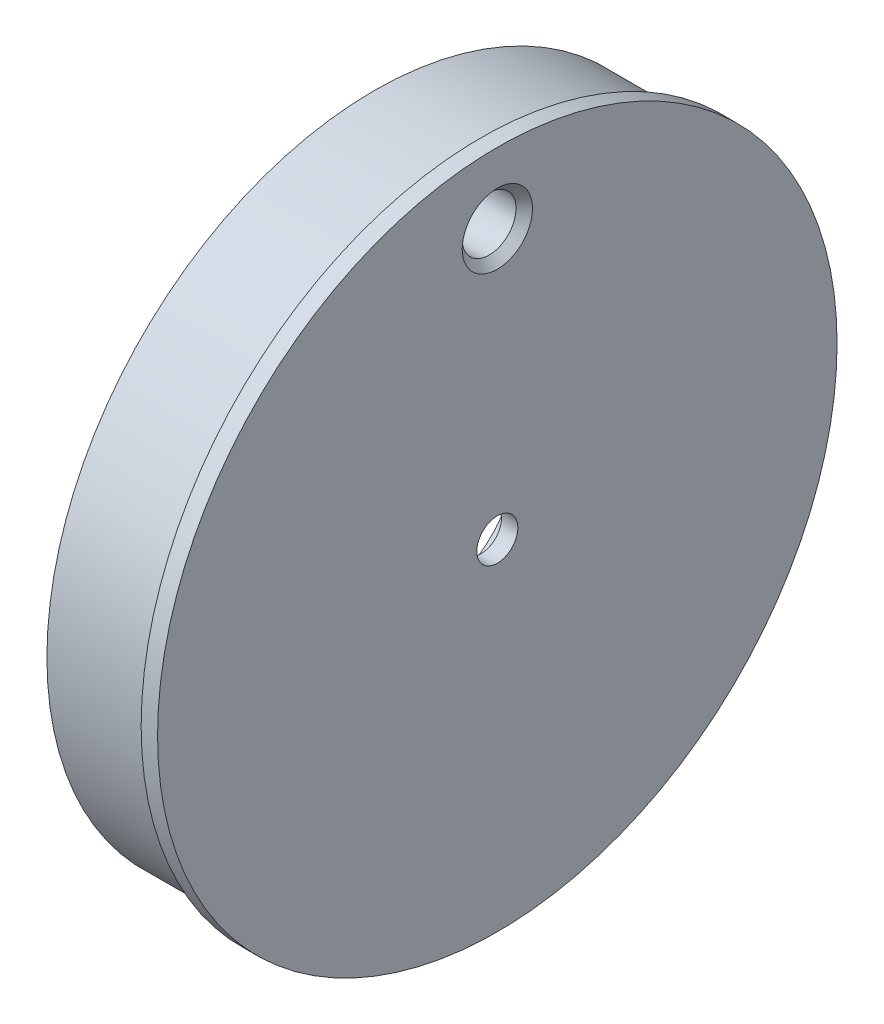
ISO-10303-21;
HEADER;
FILE_DESCRIPTION(('STEP AP214'),'2;1');
FILE_NAME('part.step','',(''),(''),'','','');
FILE_SCHEMA(('AUTOMOTIVE_DESIGN { 1 0 10303 214 1 1 1 1 }'));
ENDSEC;
DATA;
#1=APPLICATION_CONTEXT('core data for automotive mechanical design processes');
#2=APPLICATION_PROTOCOL_DEFINITION('international standard','automotive_design',2000,#1);
#3=PRODUCT_CONTEXT('',#1,'mechanical');
#4=PRODUCT('Part','Part','',(#3));
#5=PRODUCT_RELATED_PRODUCT_CATEGORY('part','',(#4));
#6=PRODUCT_DEFINITION_FORMATION('','',#4);
#7=PRODUCT_DEFINITION_CONTEXT('part definition',#1,'design');
#8=PRODUCT_DEFINITION('design','',#6,#7);
#9=PRODUCT_DEFINITION_SHAPE('','',#8);
#10=(LENGTH_UNIT() NAMED_UNIT(*) SI_UNIT(.MILLI.,.METRE.));
#11=(NAMED_UNIT(*) PLANE_ANGLE_UNIT() SI_UNIT($,.RADIAN.));
#12=(NAMED_UNIT(*) SI_UNIT($,.STERADIAN.) SOLID_ANGLE_UNIT());
#13=UNCERTAINTY_MEASURE_WITH_UNIT(LENGTH_MEASURE(1.E-05),#10,'distance_accuracy_value','');
#14=(GEOMETRIC_REPRESENTATION_CONTEXT(3) GLOBAL_UNCERTAINTY_ASSIGNED_CONTEXT((#13)) GLOBAL_UNIT_ASSIGNED_CONTEXT((#10,
#11,#12)) REPRESENTATION_CONTEXT('',''));
#15=CARTESIAN_POINT('',(0.,0.,0.));
#16=DIRECTION('',(0.,0.,1.));
#17=DIRECTION('',(1.,0.,0.));
#18=AXIS2_PLACEMENT_3D('',#15,#16,#17);
#19=CARTESIAN_POINT('',(0.,0.,0.));
#20=DIRECTION('',(1.,0.,0.));
#21=DIRECTION('',(0.,0.,-1.));
#22=AXIS2_PLACEMENT_3D('',#19,#20,#21);
#23=CYLINDRICAL_SURFACE('',#22,1.5875);
#24=CARTESIAN_POINT('',(0.,0.,0.));
#25=DIRECTION('',(1.,0.,0.));
#26=DIRECTION('',(0.,0.,-1.));
#27=AXIS2_PLACEMENT_3D('',#24,#25,#26);
#28=CIRCLE('',#27,1.5875);
#29=CARTESIAN_POINT('',(0.,0.,-1.5875));
#30=VERTEX_POINT('',#29);
#31=EDGE_CURVE('E73',#30,#30,#28,.T.);
#32=ORIENTED_EDGE('',*,*,#31,.T.);
#33=EDGE_LOOP('',(#32));
#34=FACE_BOUND('',#33,.T.);
#35=CARTESIAN_POINT('',(-1.27,0.,0.));
#36=DIRECTION('',(1.,0.,0.));
#37=DIRECTION('',(0.,0.,-1.));
#38=AXIS2_PLACEMENT_3D('',#35,#36,#37);
#39=CIRCLE('',#38,1.5875);
#40=CARTESIAN_POINT('',(-1.27,0.,-1.5875));
#41=VERTEX_POINT('',#40);
#42=EDGE_CURVE('E10',#41,#41,#39,.T.);
#43=ORIENTED_EDGE('',*,*,#42,.F.);
#44=EDGE_LOOP('',(#43));
#45=FACE_BOUND('',#44,.T.);
#46=ADVANCED_FACE('F33',(#34,#45),#23,.F.);
#47=CARTESIAN_POINT('',(-1.27,5.08,0.));
#48=DIRECTION('',(-1.,0.,0.));
#49=DIRECTION('',(0.,0.,1.));
#50=AXIS2_PLACEMENT_3D('',#47,#48,#49);
#51=PLANE('',#50);
#52=ORIENTED_EDGE('',*,*,#42,.T.);
#53=EDGE_LOOP('',(#52));
#54=FACE_BOUND('',#53,.T.);
#55=CARTESIAN_POINT('',(-1.27,0.,0.));
#56=DIRECTION('',(1.,0.,0.));
#57=DIRECTION('',(0.,0.,-1.));
#58=AXIS2_PLACEMENT_3D('',#55,#56,#57);
#59=CIRCLE('',#58,5.08);
#60=CARTESIAN_POINT('',(-1.27,0.,-5.08));
#61=VERTEX_POINT('',#60);
#62=EDGE_CURVE('E39',#61,#61,#59,.T.);
#63=ORIENTED_EDGE('',*,*,#62,.F.);
#64=EDGE_LOOP('',(#63));
#65=FACE_BOUND('',#64,.T.);
#66=ADVANCED_FACE('F143',(#54,#65),#51,.T.);
#67=CARTESIAN_POINT('',(-2.54,0.,0.));
#68=DIRECTION('',(1.,0.,0.));
#69=DIRECTION('',(0.,0.,-1.));
#70=AXIS2_PLACEMENT_3D('',#67,#68,#69);
#71=TOROIDAL_SURFACE('',#70,5.08,1.27);
#72=ORIENTED_EDGE('',*,*,#62,.T.);
#73=EDGE_LOOP('',(#72));
#74=FACE_BOUND('',#73,.T.);
#75=CARTESIAN_POINT('',(-2.54,0.,0.));
#76=DIRECTION('',(1.,0.,0.));
#77=DIRECTION('',(0.,0.,-1.));
#78=AXIS2_PLACEMENT_3D('',#75,#76,#77);
#79=CIRCLE('',#78,6.35);
#80=CARTESIAN_POINT('',(-2.54,0.,-6.35));
#81=VERTEX_POINT('',#80);
#82=EDGE_CURVE('E43',#81,#81,#79,.T.);
#83=ORIENTED_EDGE('',*,*,#82,.F.);
#84=EDGE_LOOP('',(#83));
#85=FACE_BOUND('',#84,.T.);
#86=ADVANCED_FACE('F147',(#74,#85),#71,.F.);
#87=CARTESIAN_POINT('',(0.,0.,0.));
#88=DIRECTION('',(1.,0.,0.));
#89=DIRECTION('',(0.,0.,-1.));
#90=AXIS2_PLACEMENT_3D('',#87,#88,#89);
#91=CYLINDRICAL_SURFACE('',#90,6.35);
#92=ORIENTED_EDGE('',*,*,#82,.T.);
#93=EDGE_LOOP('',(#92));
#94=FACE_BOUND('',#93,.T.);
#95=CARTESIAN_POINT('',(-4.953,0.,0.));
#96=DIRECTION('',(1.,0.,0.));
#97=DIRECTION('',(0.,0.,-1.));
#98=AXIS2_PLACEMENT_3D('',#95,#96,#97);
#99=CIRCLE('',#98,6.35);
#100=CARTESIAN_POINT('',(-4.953,0.,-6.35));
#101=VERTEX_POINT('',#100);
#102=EDGE_CURVE('E47',#101,#101,#99,.T.);
#103=ORIENTED_EDGE('',*,*,#102,.F.);
#104=EDGE_LOOP('',(#103));
#105=FACE_BOUND('',#104,.T.);
#106=ADVANCED_FACE('F151',(#94,#105),#91,.F.);
#107=CARTESIAN_POINT('',(-4.953,15.9258,0.));
#108=DIRECTION('',(-1.,0.,0.));
#109=DIRECTION('',(0.,0.,1.));
#110=AXIS2_PLACEMENT_3D('',#107,#108,#109);
#111=PLANE('',#110);
#112=ORIENTED_EDGE('',*,*,#102,.T.);
#113=EDGE_LOOP('',(#112));
#114=FACE_BOUND('',#113,.T.);
#115=CARTESIAN_POINT('',(-4.953,0.,0.));
#116=DIRECTION('',(1.,0.,0.));
#117=DIRECTION('',(0.,0.,-1.));
#118=AXIS2_PLACEMENT_3D('',#115,#116,#117);
#119=CIRCLE('',#118,15.9258);
#120=CARTESIAN_POINT('',(-4.953,0.,-15.9258));
#121=VERTEX_POINT('',#120);
#122=EDGE_CURVE('E52',#121,#121,#119,.T.);
#123=ORIENTED_EDGE('',*,*,#122,.F.);
#124=EDGE_LOOP('',(#123));
#125=FACE_BOUND('',#124,.T.);
#126=ADVANCED_FACE('F157',(#114,#125),#111,.T.);
#127=CARTESIAN_POINT('',(-6.223,0.,0.));
#128=DIRECTION('',(1.,0.,0.));
#129=DIRECTION('',(0.,0.,-1.));
#130=AXIS2_PLACEMENT_3D('',#127,#128,#129);
#131=TOROIDAL_SURFACE('',#130,15.9258,1.27);
#132=ORIENTED_EDGE('',*,*,#122,.T.);
#133=EDGE_LOOP('',(#132));
#134=FACE_BOUND('',#133,.T.);
#135=CARTESIAN_POINT('',(-6.223,0.,0.));
#136=DIRECTION('',(1.,0.,0.));
#137=DIRECTION('',(0.,0.,-1.));
#138=AXIS2_PLACEMENT_3D('',#135,#136,#137);
#139=CIRCLE('',#138,17.1958);
#140=CARTESIAN_POINT('',(-6.223,0.,-17.1958));
#141=VERTEX_POINT('',#140);
#142=EDGE_CURVE('E55',#141,#141,#139,.T.);
#143=ORIENTED_EDGE('',*,*,#142,.F.);
#144=EDGE_LOOP('',(#143));
#145=FACE_BOUND('',#144,.T.);
#146=ADVANCED_FACE('F161',(#134,#145),#131,.F.);
#147=CARTESIAN_POINT('',(0.,0.,0.));
#148=DIRECTION('',(1.,0.,0.));
#149=DIRECTION('',(0.,0.,-1.));
#150=AXIS2_PLACEMENT_3D('',#147,#148,#149);
#151=CYLINDRICAL_SURFACE('',#150,17.1958);
#152=ORIENTED_EDGE('',*,*,#142,.T.);
#153=EDGE_LOOP('',(#152));
#154=FACE_BOUND('',#153,.T.);
#155=CARTESIAN_POINT('',(-9.525,0.,0.));
#156=DIRECTION('',(1.,0.,0.));
#157=DIRECTION('',(0.,0.,-1.));
#158=AXIS2_PLACEMENT_3D('',#155,#156,#157);
#159=CIRCLE('',#158,17.1958);
#160=CARTESIAN_POINT('',(-9.525,0.,-17.1958));
#161=VERTEX_POINT('',#160);
#162=EDGE_CURVE('E58',#161,#161,#159,.T.);
#163=ORIENTED_EDGE('',*,*,#162,.F.);
#164=EDGE_LOOP('',(#163));
#165=FACE_BOUND('',#164,.T.);
#166=ADVANCED_FACE('F114',(#154,#165),#151,.F.);
#167=CARTESIAN_POINT('',(-9.525,25.3238,0.));
#168=DIRECTION('',(-1.,0.,0.));
#169=DIRECTION('',(0.,0.,1.));
#170=AXIS2_PLACEMENT_3D('',#167,#168,#169);
#171=PLANE('',#170);
#172=CARTESIAN_POINT('',(-9.525,20.828,0.));
#173=DIRECTION('',(-1.,0.,0.));
#174=DIRECTION('',(0.,0.,1.));
#175=AXIS2_PLACEMENT_3D('',#172,#173,#174);
#176=CIRCLE('',#175,2.7178);
#177=CARTESIAN_POINT('',(-9.525,20.828,2.7178));
#178=VERTEX_POINT('',#177);
#179=EDGE_CURVE('E82',#178,#178,#176,.T.);
#180=ORIENTED_EDGE('',*,*,#179,.F.);
#181=EDGE_LOOP('',(#180));
#182=FACE_BOUND('',#181,.T.);
#183=ORIENTED_EDGE('',*,*,#162,.T.);
#184=EDGE_LOOP('',(#183));
#185=FACE_BOUND('',#184,.T.);
#186=CARTESIAN_POINT('',(-9.525,0.,0.));
#187=DIRECTION('',(1.,0.,0.));
#188=DIRECTION('',(0.,0.,-1.));
#189=AXIS2_PLACEMENT_3D('',#186,#187,#188);
#190=CIRCLE('',#189,25.3238);
#191=CARTESIAN_POINT('',(-9.525,0.,-25.3238));
#192=VERTEX_POINT('',#191);
#193=EDGE_CURVE('E61',#192,#192,#190,.T.);
#194=ORIENTED_EDGE('',*,*,#193,.F.);
#195=EDGE_LOOP('',(#194));
#196=FACE_BOUND('',#195,.T.);
#197=ADVANCED_FACE('F110',(#182,#185,#196),#171,.T.);
#198=CARTESIAN_POINT('',(0.,0.,0.));
#199=DIRECTION('',(1.,0.,0.));
#200=DIRECTION('',(0.,0.,-1.));
#201=AXIS2_PLACEMENT_3D('',#198,#199,#200);
#202=CYLINDRICAL_SURFACE('',#201,25.3238);
#203=ORIENTED_EDGE('',*,*,#193,.T.);
#204=EDGE_LOOP('',(#203));
#205=FACE_BOUND('',#204,.T.);
#206=CARTESIAN_POINT('',(-1.27,0.,0.));
#207=DIRECTION('',(1.,0.,0.));
#208=DIRECTION('',(0.,0.,-1.));
#209=AXIS2_PLACEMENT_3D('',#206,#207,#208);
#210=CIRCLE('',#209,25.3238);
#211=CARTESIAN_POINT('',(-1.27,0.,-25.3238));
#212=VERTEX_POINT('',#211);
#213=EDGE_CURVE('E64',#212,#212,#210,.T.);
#214=ORIENTED_EDGE('',*,*,#213,.F.);
#215=EDGE_LOOP('',(#214));
#216=FACE_BOUND('',#215,.T.);
#217=ADVANCED_FACE('F113',(#205,#216),#202,.T.);
#218=CARTESIAN_POINT('',(-1.27,26.289,0.));
#219=DIRECTION('',(-1.,0.,0.));
#220=DIRECTION('',(0.,0.,1.));
#221=AXIS2_PLACEMENT_3D('',#218,#219,#220);
#222=PLANE('',#221);
#223=ORIENTED_EDGE('',*,*,#213,.T.);
#224=EDGE_LOOP('',(#223));
#225=FACE_BOUND('',#224,.T.);
#226=CARTESIAN_POINT('',(-1.27,0.,0.));
#227=DIRECTION('',(1.,0.,0.));
#228=DIRECTION('',(0.,0.,-1.));
#229=AXIS2_PLACEMENT_3D('',#226,#227,#228);
#230=CIRCLE('',#229,26.289);
#231=CARTESIAN_POINT('',(-1.27,0.,-26.289));
#232=VERTEX_POINT('',#231);
#233=EDGE_CURVE('E67',#232,#232,#230,.T.);
#234=ORIENTED_EDGE('',*,*,#233,.F.);
#235=EDGE_LOOP('',(#234));
#236=FACE_BOUND('',#235,.T.);
#237=ADVANCED_FACE('F122',(#225,#236),#222,.T.);
#238=CARTESIAN_POINT('',(0.,0.,0.));
#239=DIRECTION('',(1.,0.,0.));
#240=DIRECTION('',(0.,0.,-1.));
#241=AXIS2_PLACEMENT_3D('',#238,#239,#240);
#242=CYLINDRICAL_SURFACE('',#241,26.289);
#243=ORIENTED_EDGE('',*,*,#233,.T.);
#244=EDGE_LOOP('',(#243));
#245=FACE_BOUND('',#244,.T.);
#246=CARTESIAN_POINT('',(0.,0.,0.));
#247=DIRECTION('',(1.,0.,0.));
#248=DIRECTION('',(0.,0.,-1.));
#249=AXIS2_PLACEMENT_3D('',#246,#247,#248);
#250=CIRCLE('',#249,26.289);
#251=CARTESIAN_POINT('',(0.,0.,-26.289));
#252=VERTEX_POINT('',#251);
#253=EDGE_CURVE('E70',#252,#252,#250,.T.);
#254=ORIENTED_EDGE('',*,*,#253,.F.);
#255=EDGE_LOOP('',(#254));
#256=FACE_BOUND('',#255,.T.);
#257=ADVANCED_FACE('F128',(#245,#256),#242,.T.);
#258=CARTESIAN_POINT('',(0.,1.5875,0.));
#259=DIRECTION('',(1.,0.,0.));
#260=DIRECTION('',(0.,0.,-1.));
#261=AXIS2_PLACEMENT_3D('',#258,#259,#260);
#262=PLANE('',#261);
#263=CARTESIAN_POINT('',(0.,20.828,0.));
#264=DIRECTION('',(-1.,0.,0.));
#265=DIRECTION('',(0.,0.,1.));
#266=AXIS2_PLACEMENT_3D('',#263,#264,#265);
#267=CIRCLE('',#266,2.7178);
#268=CARTESIAN_POINT('',(0.,20.828,2.7178));
#269=VERTEX_POINT('',#268);
#270=EDGE_CURVE('E85',#269,#269,#267,.T.);
#271=ORIENTED_EDGE('',*,*,#270,.T.);
#272=EDGE_LOOP('',(#271));
#273=FACE_BOUND('',#272,.T.);
#274=ORIENTED_EDGE('',*,*,#253,.T.);
#275=EDGE_LOOP('',(#274));
#276=FACE_BOUND('',#275,.T.);
#277=ORIENTED_EDGE('',*,*,#31,.F.);
#278=EDGE_LOOP('',(#277));
#279=FACE_BOUND('',#278,.T.);
#280=ADVANCED_FACE('F89',(#273,#276,#279),#262,.T.);
#281=CARTESIAN_POINT('',(-0.635000000000002,20.828,0.));
#282=DIRECTION('',(1.,0.,0.));
#283=DIRECTION('',(0.,0.,-1.));
#284=AXIS2_PLACEMENT_3D('',#281,#282,#283);
#285=CONICAL_SURFACE('',#284,2.0828,0.785398163397448);
#286=ORIENTED_EDGE('',*,*,#270,.F.);
#287=EDGE_LOOP('',(#286));
#288=FACE_BOUND('',#287,.T.);
#289=CARTESIAN_POINT('',(-0.635000000000002,20.828,0.));
#290=DIRECTION('',(-1.,0.,0.));
#291=DIRECTION('',(0.,0.,1.));
#292=AXIS2_PLACEMENT_3D('',#289,#290,#291);
#293=CIRCLE('',#292,2.0828);
#294=CARTESIAN_POINT('',(-0.635000000000002,20.828,2.0828));
#295=VERTEX_POINT('',#294);
#296=EDGE_CURVE('E76',#295,#295,#293,.T.);
#297=ORIENTED_EDGE('',*,*,#296,.T.);
#298=EDGE_LOOP('',(#297));
#299=FACE_BOUND('',#298,.T.);
#300=ADVANCED_FACE('F92',(#288,#299),#285,.F.);
#301=CARTESIAN_POINT('',(-9.525,20.828,0.));
#302=DIRECTION('',(-1.,0.,0.));
#303=DIRECTION('',(0.,0.,1.));
#304=AXIS2_PLACEMENT_3D('',#301,#302,#303);
#305=CYLINDRICAL_SURFACE('',#304,2.0828);
#306=ORIENTED_EDGE('',*,*,#296,.F.);
#307=EDGE_LOOP('',(#306));
#308=FACE_BOUND('',#307,.T.);
#309=CARTESIAN_POINT('',(-8.89,20.828,0.));
#310=DIRECTION('',(-1.,0.,0.));
#311=DIRECTION('',(0.,0.,1.));
#312=AXIS2_PLACEMENT_3D('',#309,#310,#311);
#313=CIRCLE('',#312,2.0828);
#314=CARTESIAN_POINT('',(-8.89,20.828,2.0828));
#315=VERTEX_POINT('',#314);
#316=EDGE_CURVE('E79',#315,#315,#313,.T.);
#317=ORIENTED_EDGE('',*,*,#316,.T.);
#318=EDGE_LOOP('',(#317));
#319=FACE_BOUND('',#318,.T.);
#320=ADVANCED_FACE('F95',(#308,#319),#305,.F.);
#321=CARTESIAN_POINT('',(-9.525,20.828,0.));
#322=DIRECTION('',(-1.,0.,0.));
#323=DIRECTION('',(0.,0.,1.));
#324=AXIS2_PLACEMENT_3D('',#321,#322,#323);
#325=CONICAL_SURFACE('',#324,2.7178,0.785398163397447);
#326=ORIENTED_EDGE('',*,*,#316,.F.);
#327=EDGE_LOOP('',(#326));
#328=FACE_BOUND('',#327,.T.);
#329=ORIENTED_EDGE('',*,*,#179,.T.);
#330=EDGE_LOOP('',(#329));
#331=FACE_BOUND('',#330,.T.);
#332=ADVANCED_FACE('F101',(#328,#331),#325,.F.);
#333=CLOSED_SHELL('',(#46,#66,#86,#106,#126,#146,#166,#197,#217,#237,#257,#280,#300,#320,#332));
#334=MANIFOLD_SOLID_BREP('B2',#333);
#335=ADVANCED_BREP_SHAPE_REPRESENTATION('',(#18,#334),#14);
#336=SHAPE_DEFINITION_REPRESENTATION(#9,#335);
ENDSEC;
END-ISO-10303-21;
